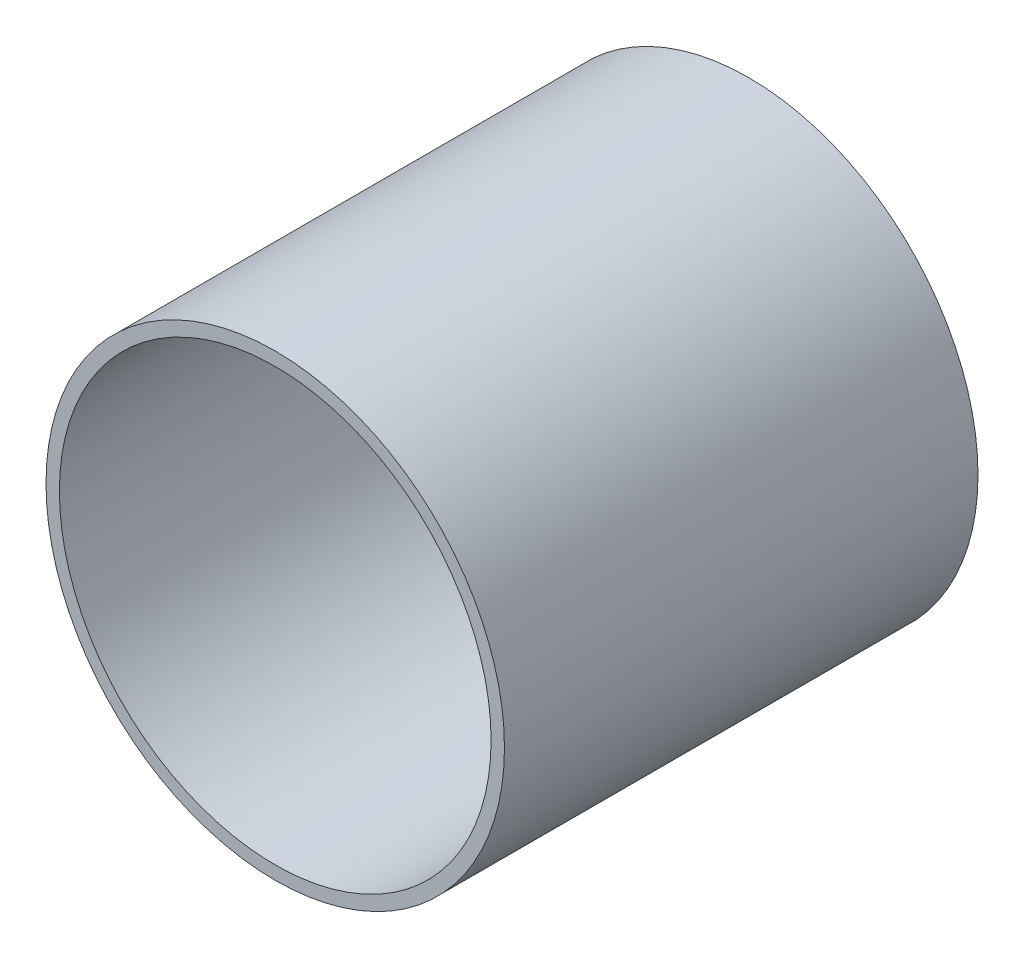
ISO-10303-21;
HEADER;
FILE_DESCRIPTION(('STEP AP214'),'2;1');
FILE_NAME('part.step','',(''),(''),'','','');
FILE_SCHEMA(('AUTOMOTIVE_DESIGN { 1 0 10303 214 1 1 1 1 }'));
ENDSEC;
DATA;
#1=APPLICATION_CONTEXT('core data for automotive mechanical design processes');
#2=APPLICATION_PROTOCOL_DEFINITION('international standard','automotive_design',2000,#1);
#3=PRODUCT_CONTEXT('',#1,'mechanical');
#4=PRODUCT('Part','Part','',(#3));
#5=PRODUCT_RELATED_PRODUCT_CATEGORY('part','',(#4));
#6=PRODUCT_DEFINITION_FORMATION('','',#4);
#7=PRODUCT_DEFINITION_CONTEXT('part definition',#1,'design');
#8=PRODUCT_DEFINITION('design','',#6,#7);
#9=PRODUCT_DEFINITION_SHAPE('','',#8);
#10=(LENGTH_UNIT() NAMED_UNIT(*) SI_UNIT(.MILLI.,.METRE.));
#11=(NAMED_UNIT(*) PLANE_ANGLE_UNIT() SI_UNIT($,.RADIAN.));
#12=(NAMED_UNIT(*) SI_UNIT($,.STERADIAN.) SOLID_ANGLE_UNIT());
#13=UNCERTAINTY_MEASURE_WITH_UNIT(LENGTH_MEASURE(1.E-05),#10,'distance_accuracy_value','');
#14=(GEOMETRIC_REPRESENTATION_CONTEXT(3) GLOBAL_UNCERTAINTY_ASSIGNED_CONTEXT((#13)) GLOBAL_UNIT_ASSIGNED_CONTEXT((#10,
#11,#12)) REPRESENTATION_CONTEXT('',''));
#15=CARTESIAN_POINT('',(0.,0.,0.));
#16=DIRECTION('',(0.,0.,1.));
#17=DIRECTION('',(1.,0.,0.));
#18=AXIS2_PLACEMENT_3D('',#15,#16,#17);
#19=CARTESIAN_POINT('',(0.,0.,167.623629022557));
#20=DIRECTION('',(0.,0.,-1.));
#21=DIRECTION('',(-1.,0.,0.));
#22=AXIS2_PLACEMENT_3D('',#19,#20,#21);
#23=CYLINDRICAL_SURFACE('',#22,34.25);
#24=CARTESIAN_POINT('',(0.,0.,0.));
#25=DIRECTION('',(0.,0.,1.));
#26=DIRECTION('',(1.,0.,0.));
#27=AXIS2_PLACEMENT_3D('',#24,#25,#26);
#28=CIRCLE('',#27,34.25);
#29=CARTESIAN_POINT('',(34.25,0.,0.));
#30=VERTEX_POINT('',#29);
#31=EDGE_CURVE('E38',#30,#30,#28,.T.);
#32=ORIENTED_EDGE('',*,*,#31,.T.);
#33=EDGE_LOOP('',(#32));
#34=FACE_BOUND('',#33,.T.);
#35=CARTESIAN_POINT('',(0.,0.,70.75));
#36=DIRECTION('',(0.,0.,1.));
#37=DIRECTION('',(1.,0.,0.));
#38=AXIS2_PLACEMENT_3D('',#35,#36,#37);
#39=CIRCLE('',#38,34.25);
#40=CARTESIAN_POINT('',(34.25,0.,70.75));
#41=VERTEX_POINT('',#40);
#42=EDGE_CURVE('E10',#41,#41,#39,.T.);
#43=ORIENTED_EDGE('',*,*,#42,.F.);
#44=EDGE_LOOP('',(#43));
#45=FACE_BOUND('',#44,.T.);
#46=ADVANCED_FACE('F31',(#34,#45),#23,.T.);
#47=CARTESIAN_POINT('',(0.,0.,0.));
#48=DIRECTION('',(0.,0.,1.));
#49=DIRECTION('',(1.,0.,0.));
#50=AXIS2_PLACEMENT_3D('',#47,#48,#49);
#51=PLANE('',#50);
#52=ORIENTED_EDGE('',*,*,#31,.F.);
#53=EDGE_LOOP('',(#52));
#54=FACE_BOUND('',#53,.T.);
#55=CARTESIAN_POINT('',(0.,0.,0.));
#56=DIRECTION('',(0.,0.,1.));
#57=DIRECTION('',(1.,0.,0.));
#58=AXIS2_PLACEMENT_3D('',#55,#56,#57);
#59=CIRCLE('',#58,32.25);
#60=CARTESIAN_POINT('',(32.25,0.,0.));
#61=VERTEX_POINT('',#60);
#62=EDGE_CURVE('E43',#61,#61,#59,.T.);
#63=ORIENTED_EDGE('',*,*,#62,.T.);
#64=EDGE_LOOP('',(#63));
#65=FACE_BOUND('',#64,.T.);
#66=ADVANCED_FACE('F59',(#54,#65),#51,.F.);
#67=CARTESIAN_POINT('',(0.,0.,167.623629022557));
#68=DIRECTION('',(0.,0.,-1.));
#69=DIRECTION('',(-1.,0.,0.));
#70=AXIS2_PLACEMENT_3D('',#67,#68,#69);
#71=CYLINDRICAL_SURFACE('',#70,32.25);
#72=ORIENTED_EDGE('',*,*,#62,.F.);
#73=EDGE_LOOP('',(#72));
#74=FACE_BOUND('',#73,.T.);
#75=CARTESIAN_POINT('',(0.,0.,70.75));
#76=DIRECTION('',(0.,0.,1.));
#77=DIRECTION('',(1.,0.,0.));
#78=AXIS2_PLACEMENT_3D('',#75,#76,#77);
#79=CIRCLE('',#78,32.25);
#80=CARTESIAN_POINT('',(32.25,0.,70.75));
#81=VERTEX_POINT('',#80);
#82=EDGE_CURVE('E34',#81,#81,#79,.T.);
#83=ORIENTED_EDGE('',*,*,#82,.T.);
#84=EDGE_LOOP('',(#83));
#85=FACE_BOUND('',#84,.T.);
#86=ADVANCED_FACE('F51',(#74,#85),#71,.F.);
#87=CARTESIAN_POINT('',(0.,0.,70.75));
#88=DIRECTION('',(0.,0.,1.));
#89=DIRECTION('',(-0.837169104331222,0.546944138603989,0.));
#90=AXIS2_PLACEMENT_3D('',#87,#88,#89);
#91=PLANE('',#90);
#92=ORIENTED_EDGE('',*,*,#82,.F.);
#93=EDGE_LOOP('',(#92));
#94=FACE_BOUND('',#93,.T.);
#95=ORIENTED_EDGE('',*,*,#42,.T.);
#96=EDGE_LOOP('',(#95));
#97=FACE_BOUND('',#96,.T.);
#98=ADVANCED_FACE('F53',(#94,#97),#91,.T.);
#99=CLOSED_SHELL('',(#46,#66,#86,#98));
#100=MANIFOLD_SOLID_BREP('B2',#99);
#101=ADVANCED_BREP_SHAPE_REPRESENTATION('',(#18,#100),#14);
#102=SHAPE_DEFINITION_REPRESENTATION(#9,#101);
ENDSEC;
END-ISO-10303-21;
